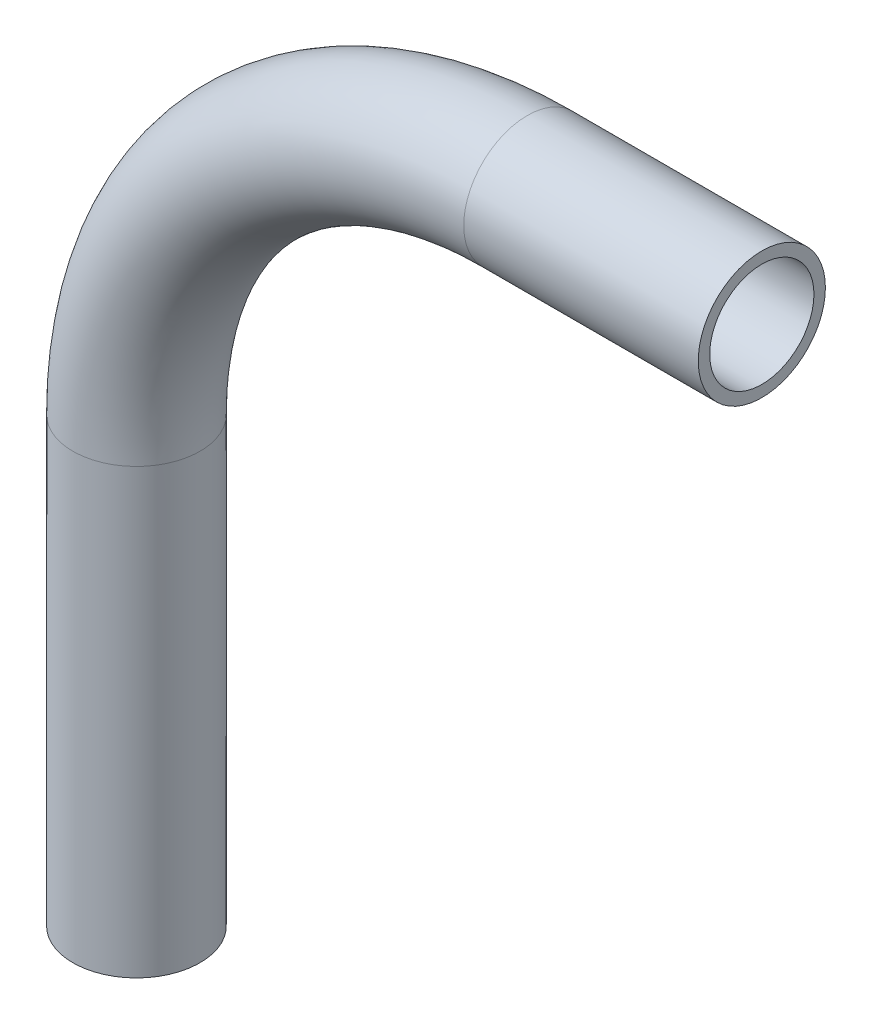
ISO-10303-21;
HEADER;
FILE_DESCRIPTION(('STEP AP214'),'2;1');
FILE_NAME('part.step','',(''),(''),'','','');
FILE_SCHEMA(('AUTOMOTIVE_DESIGN { 1 0 10303 214 1 1 1 1 }'));
ENDSEC;
DATA;
#1=APPLICATION_CONTEXT('core data for automotive mechanical design processes');
#2=APPLICATION_PROTOCOL_DEFINITION('international standard','automotive_design',2000,#1);
#3=PRODUCT_CONTEXT('',#1,'mechanical');
#4=PRODUCT('Part','Part','',(#3));
#5=PRODUCT_RELATED_PRODUCT_CATEGORY('part','',(#4));
#6=PRODUCT_DEFINITION_FORMATION('','',#4);
#7=PRODUCT_DEFINITION_CONTEXT('part definition',#1,'design');
#8=PRODUCT_DEFINITION('design','',#6,#7);
#9=PRODUCT_DEFINITION_SHAPE('','',#8);
#10=(LENGTH_UNIT() NAMED_UNIT(*) SI_UNIT(.MILLI.,.METRE.));
#11=(NAMED_UNIT(*) PLANE_ANGLE_UNIT() SI_UNIT($,.RADIAN.));
#12=(NAMED_UNIT(*) SI_UNIT($,.STERADIAN.) SOLID_ANGLE_UNIT());
#13=UNCERTAINTY_MEASURE_WITH_UNIT(LENGTH_MEASURE(1.E-05),#10,'distance_accuracy_value','');
#14=(GEOMETRIC_REPRESENTATION_CONTEXT(3) GLOBAL_UNCERTAINTY_ASSIGNED_CONTEXT((#13)) GLOBAL_UNIT_ASSIGNED_CONTEXT((#10,
#11,#12)) REPRESENTATION_CONTEXT('',''));
#15=CARTESIAN_POINT('',(0.,0.,0.));
#16=DIRECTION('',(0.,0.,1.));
#17=DIRECTION('',(1.,0.,0.));
#18=AXIS2_PLACEMENT_3D('',#15,#16,#17);
#19=CARTESIAN_POINT('',(-6.07620592458876E-13,-50.8,0.));
#20=DIRECTION('',(0.,1.,0.));
#21=DIRECTION('',(-1.,0.,0.));
#22=AXIS2_PLACEMENT_3D('',#19,#20,#21);
#23=CYLINDRICAL_SURFACE('',#22,3.8735);
#24=CARTESIAN_POINT('',(-2.84494650060196E-13,-23.8125000000001,0.));
#25=DIRECTION('',(0.,1.,0.));
#26=DIRECTION('',(0.,0.,-1.));
#27=AXIS2_PLACEMENT_3D('',#24,#25,#26);
#28=CIRCLE('',#27,3.8735);
#29=CARTESIAN_POINT('',(-3.87350000000028,-23.8125,0.));
#30=VERTEX_POINT('',#29);
#31=EDGE_CURVE('E80',#30,#30,#28,.T.);
#32=ORIENTED_EDGE('',*,*,#31,.F.);
#33=EDGE_LOOP('',(#32));
#34=FACE_BOUND('',#33,.T.);
#35=CARTESIAN_POINT('',(-6.07620592458876E-13,-50.8,0.));
#36=DIRECTION('',(0.,1.,0.));
#37=DIRECTION('',(0.,0.,-1.));
#38=AXIS2_PLACEMENT_3D('',#35,#36,#37);
#39=CIRCLE('',#38,3.8735);
#40=CARTESIAN_POINT('',(-6.07620592458876E-13,-50.8,-3.8735));
#41=VERTEX_POINT('',#40);
#42=EDGE_CURVE('E49',#41,#41,#39,.T.);
#43=ORIENTED_EDGE('',*,*,#42,.T.);
#44=EDGE_LOOP('',(#43));
#45=FACE_BOUND('',#44,.T.);
#46=ADVANCED_FACE('F34',(#34,#45),#23,.T.);
#47=CARTESIAN_POINT('',(23.8124999999997,-23.8125000000004,0.));
#48=DIRECTION('',(0.,0.,-1.));
#49=DIRECTION('',(-1.,0.,0.));
#50=AXIS2_PLACEMENT_3D('',#47,#48,#49);
#51=TOROIDAL_SURFACE('',#50,23.8125,3.8735);
#52=CARTESIAN_POINT('',(23.8125000000001,-3.74030180194451E-13,0.));
#53=DIRECTION('',(1.,0.,0.));
#54=DIRECTION('',(0.,0.,-1.));
#55=AXIS2_PLACEMENT_3D('',#52,#53,#54);
#56=CIRCLE('',#55,3.8735);
#57=CARTESIAN_POINT('',(23.8125000000002,3.87349999999963,0.));
#58=VERTEX_POINT('',#57);
#59=EDGE_CURVE('E38',#58,#58,#56,.T.);
#60=CARTESIAN_POINT('',(23.8124999999997,-23.8125000000004,0.));
#61=DIRECTION('',(0.,0.,-1.));
#62=DIRECTION('',(-1.,0.,0.));
#63=AXIS2_PLACEMENT_3D('',#60,#61,#62);
#64=CIRCLE('',#63,27.686);
#65=EDGE_CURVE('',#30,#58,#64,.T.);
#66=ORIENTED_EDGE('',*,*,#31,.T.);
#67=ORIENTED_EDGE('',*,*,#59,.F.);
#68=ORIENTED_EDGE('',*,*,#65,.T.);
#69=ORIENTED_EDGE('',*,*,#65,.F.);
#70=EDGE_LOOP('',(#66,#68,#67,#69));
#71=FACE_BOUND('',#70,.T.);
#72=ADVANCED_FACE('F88',(#71),#51,.T.);
#73=CARTESIAN_POINT('',(23.8125000000001,-3.78169717762944E-13,0.));
#74=DIRECTION('',(1.,0.,0.));
#75=DIRECTION('',(0.,1.,0.));
#76=AXIS2_PLACEMENT_3D('',#73,#74,#75);
#77=CYLINDRICAL_SURFACE('',#76,3.8735);
#78=CARTESIAN_POINT('',(38.1,-6.02738596268335E-13,0.));
#79=DIRECTION('',(1.,0.,0.));
#80=DIRECTION('',(0.,0.,-1.));
#81=AXIS2_PLACEMENT_3D('',#78,#79,#80);
#82=CIRCLE('',#81,3.8735);
#83=CARTESIAN_POINT('',(38.1,-6.02738596268335E-13,-3.8735));
#84=VERTEX_POINT('',#83);
#85=EDGE_CURVE('E54',#84,#84,#82,.T.);
#86=ORIENTED_EDGE('',*,*,#85,.F.);
#87=EDGE_LOOP('',(#86));
#88=FACE_BOUND('',#87,.T.);
#89=ORIENTED_EDGE('',*,*,#59,.T.);
#90=EDGE_LOOP('',(#89));
#91=FACE_BOUND('',#90,.T.);
#92=ADVANCED_FACE('F36',(#88,#91),#77,.T.);
#93=CARTESIAN_POINT('',(-6.07620592458876E-13,-50.8,0.));
#94=DIRECTION('',(0.,1.,0.));
#95=DIRECTION('',(0.,0.,-1.));
#96=AXIS2_PLACEMENT_3D('',#93,#94,#95);
#97=PLANE('',#96);
#98=CARTESIAN_POINT('',(-6.07620592458876E-13,-50.8,0.));
#99=DIRECTION('',(0.,1.,0.));
#100=DIRECTION('',(0.,0.,-1.));
#101=AXIS2_PLACEMENT_3D('',#98,#99,#100);
#102=CIRCLE('',#101,3.175);
#103=CARTESIAN_POINT('',(-6.07620592458876E-13,-50.8,-3.175));
#104=VERTEX_POINT('',#103);
#105=EDGE_CURVE('E75',#104,#104,#102,.F.);
#106=ORIENTED_EDGE('',*,*,#105,.F.);
#107=EDGE_LOOP('',(#106));
#108=FACE_BOUND('',#107,.T.);
#109=ORIENTED_EDGE('',*,*,#42,.F.);
#110=EDGE_LOOP('',(#109));
#111=FACE_BOUND('',#110,.T.);
#112=ADVANCED_FACE('F94',(#108,#111),#97,.F.);
#113=CARTESIAN_POINT('',(38.1,-6.02738596268335E-13,0.));
#114=DIRECTION('',(1.,0.,0.));
#115=DIRECTION('',(0.,0.,-1.));
#116=AXIS2_PLACEMENT_3D('',#113,#114,#115);
#117=PLANE('',#116);
#118=CARTESIAN_POINT('',(38.1,-6.02738596268335E-13,0.));
#119=DIRECTION('',(1.,0.,0.));
#120=DIRECTION('',(0.,0.,-1.));
#121=AXIS2_PLACEMENT_3D('',#118,#119,#120);
#122=CIRCLE('',#121,3.175);
#123=CARTESIAN_POINT('',(38.1,-6.02738596268335E-13,-3.175));
#124=VERTEX_POINT('',#123);
#125=EDGE_CURVE('E11',#124,#124,#122,.F.);
#126=ORIENTED_EDGE('',*,*,#125,.T.);
#127=EDGE_LOOP('',(#126));
#128=FACE_BOUND('',#127,.T.);
#129=ORIENTED_EDGE('',*,*,#85,.T.);
#130=EDGE_LOOP('',(#129));
#131=FACE_BOUND('',#130,.T.);
#132=ADVANCED_FACE('F61',(#128,#131),#117,.T.);
#133=CARTESIAN_POINT('',(-6.07620592458876E-13,-50.8,0.));
#134=DIRECTION('',(0.,1.,0.));
#135=DIRECTION('',(-1.,0.,0.));
#136=AXIS2_PLACEMENT_3D('',#133,#134,#135);
#137=CYLINDRICAL_SURFACE('',#136,3.175);
#138=CARTESIAN_POINT('',(-2.84494650060196E-13,-23.8125000000001,0.));
#139=DIRECTION('',(0.,1.,0.));
#140=DIRECTION('',(0.,0.,-1.));
#141=AXIS2_PLACEMENT_3D('',#138,#139,#140);
#142=CIRCLE('',#141,3.175);
#143=CARTESIAN_POINT('',(-3.17500000000028,-23.8125000000001,0.));
#144=VERTEX_POINT('',#143);
#145=EDGE_CURVE('E72',#144,#144,#142,.F.);
#146=ORIENTED_EDGE('',*,*,#145,.F.);
#147=EDGE_LOOP('',(#146));
#148=FACE_BOUND('',#147,.T.);
#149=ORIENTED_EDGE('',*,*,#105,.T.);
#150=EDGE_LOOP('',(#149));
#151=FACE_BOUND('',#150,.T.);
#152=ADVANCED_FACE('F102',(#148,#151),#137,.F.);
#153=CARTESIAN_POINT('',(23.8124999999997,-23.8125000000004,0.));
#154=DIRECTION('',(0.,0.,-1.));
#155=DIRECTION('',(-1.,0.,0.));
#156=AXIS2_PLACEMENT_3D('',#153,#154,#155);
#157=TOROIDAL_SURFACE('',#156,23.8125,3.175);
#158=CARTESIAN_POINT('',(23.8125000000001,-3.74030180194451E-13,0.));
#159=DIRECTION('',(1.,0.,0.));
#160=DIRECTION('',(0.,0.,-1.));
#161=AXIS2_PLACEMENT_3D('',#158,#159,#160);
#162=CIRCLE('',#161,3.175);
#163=CARTESIAN_POINT('',(23.8125000000001,3.17499999999963,0.));
#164=VERTEX_POINT('',#163);
#165=EDGE_CURVE('E43',#164,#164,#162,.F.);
#166=CARTESIAN_POINT('',(23.8124999999997,-23.8125000000004,0.));
#167=DIRECTION('',(0.,0.,-1.));
#168=DIRECTION('',(-1.,0.,0.));
#169=AXIS2_PLACEMENT_3D('',#166,#167,#168);
#170=CIRCLE('',#169,26.9875);
#171=EDGE_CURVE('',#144,#164,#170,.T.);
#172=ORIENTED_EDGE('',*,*,#145,.T.);
#173=ORIENTED_EDGE('',*,*,#165,.F.);
#174=ORIENTED_EDGE('',*,*,#171,.T.);
#175=ORIENTED_EDGE('',*,*,#171,.F.);
#176=EDGE_LOOP('',(#172,#174,#173,#175));
#177=FACE_BOUND('',#176,.T.);
#178=ADVANCED_FACE('F67',(#177),#157,.F.);
#179=CARTESIAN_POINT('',(23.8125000000001,-3.78169717762944E-13,0.));
#180=DIRECTION('',(1.,0.,0.));
#181=DIRECTION('',(0.,1.,0.));
#182=AXIS2_PLACEMENT_3D('',#179,#180,#181);
#183=CYLINDRICAL_SURFACE('',#182,3.175);
#184=ORIENTED_EDGE('',*,*,#125,.F.);
#185=EDGE_LOOP('',(#184));
#186=FACE_BOUND('',#185,.T.);
#187=ORIENTED_EDGE('',*,*,#165,.T.);
#188=EDGE_LOOP('',(#187));
#189=FACE_BOUND('',#188,.T.);
#190=ADVANCED_FACE('F64',(#186,#189),#183,.F.);
#191=CLOSED_SHELL('',(#46,#72,#92,#112,#132,#152,#178,#190));
#192=MANIFOLD_SOLID_BREP('B2',#191);
#193=ADVANCED_BREP_SHAPE_REPRESENTATION('',(#18,#192),#14);
#194=SHAPE_DEFINITION_REPRESENTATION(#9,#193);
ENDSEC;
END-ISO-10303-21;
